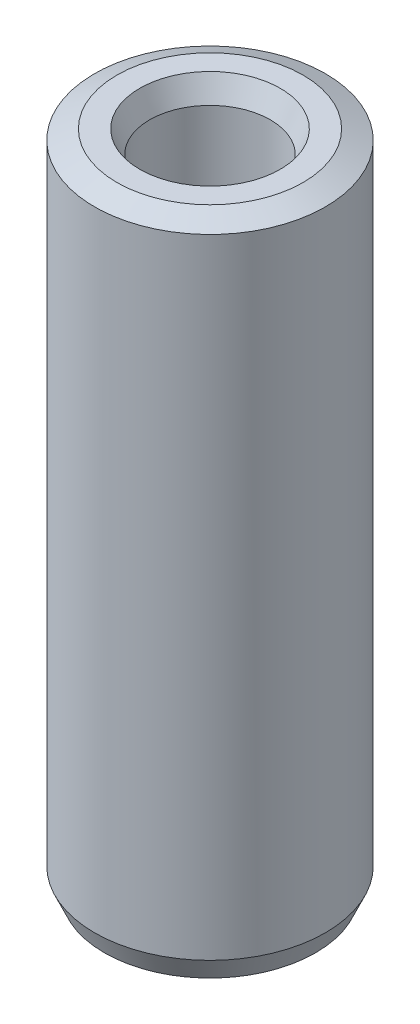
ISO-10303-21;
HEADER;
FILE_DESCRIPTION(('STEP AP214'),'2;1');
FILE_NAME('part.step','',(''),(''),'','','');
FILE_SCHEMA(('AUTOMOTIVE_DESIGN { 1 0 10303 214 1 1 1 1 }'));
ENDSEC;
DATA;
#1=APPLICATION_CONTEXT('core data for automotive mechanical design processes');
#2=APPLICATION_PROTOCOL_DEFINITION('international standard','automotive_design',2000,#1);
#3=PRODUCT_CONTEXT('',#1,'mechanical');
#4=PRODUCT('Part','Part','',(#3));
#5=PRODUCT_RELATED_PRODUCT_CATEGORY('part','',(#4));
#6=PRODUCT_DEFINITION_FORMATION('','',#4);
#7=PRODUCT_DEFINITION_CONTEXT('part definition',#1,'design');
#8=PRODUCT_DEFINITION('design','',#6,#7);
#9=PRODUCT_DEFINITION_SHAPE('','',#8);
#10=(LENGTH_UNIT() NAMED_UNIT(*) SI_UNIT(.MILLI.,.METRE.));
#11=(NAMED_UNIT(*) PLANE_ANGLE_UNIT() SI_UNIT($,.RADIAN.));
#12=(NAMED_UNIT(*) SI_UNIT($,.STERADIAN.) SOLID_ANGLE_UNIT());
#13=UNCERTAINTY_MEASURE_WITH_UNIT(LENGTH_MEASURE(1.E-05),#10,'distance_accuracy_value','');
#14=(GEOMETRIC_REPRESENTATION_CONTEXT(3) GLOBAL_UNCERTAINTY_ASSIGNED_CONTEXT((#13)) GLOBAL_UNIT_ASSIGNED_CONTEXT((#10,
#11,#12)) REPRESENTATION_CONTEXT('',''));
#15=CARTESIAN_POINT('',(0.,0.,0.));
#16=DIRECTION('',(0.,0.,1.));
#17=DIRECTION('',(1.,0.,0.));
#18=AXIS2_PLACEMENT_3D('',#15,#16,#17);
#19=CARTESIAN_POINT('',(0.,42.9435766198368,0.));
#20=DIRECTION('',(0.,-1.,0.));
#21=DIRECTION('',(0.,0.,-1.));
#22=AXIS2_PLACEMENT_3D('',#19,#20,#21);
#23=CYLINDRICAL_SURFACE('',#22,7.5);
#24=CARTESIAN_POINT('',(0.,1.45216016228165,0.));
#25=DIRECTION('',(0.,1.,0.));
#26=DIRECTION('',(0.,0.,1.));
#27=AXIS2_PLACEMENT_3D('',#24,#25,#26);
#28=CIRCLE('',#27,7.5);
#29=CARTESIAN_POINT('',(0.,1.45216016228165,-7.5));
#30=VERTEX_POINT('',#29);
#31=EDGE_CURVE('E10',#30,#30,#28,.T.);
#32=CARTESIAN_POINT('',(0.,42.2998248799971,0.));
#33=DIRECTION('',(0.,1.,0.));
#34=DIRECTION('',(0.,0.,1.));
#35=AXIS2_PLACEMENT_3D('',#32,#33,#34);
#36=CIRCLE('',#35,7.5);
#37=CARTESIAN_POINT('',(0.,42.2998248799971,-7.5));
#38=VERTEX_POINT('',#37);
#39=EDGE_CURVE('E50',#38,#38,#36,.F.);
#40=CARTESIAN_POINT('',(0.,1.45216016228165,-7.5));
#41=CARTESIAN_POINT('',(0.,1.87765666975785,-7.5));
#42=CARTESIAN_POINT('',(0.,2.30315317723405,-7.5));
#43=CARTESIAN_POINT('',(0.,3.15414619218646,-7.5));
#44=CARTESIAN_POINT('',(0.,3.57964269966266,-7.5));
#45=CARTESIAN_POINT('',(0.,4.43063571461507,-7.5));
#46=CARTESIAN_POINT('',(0.,4.85613222209127,-7.5));
#47=CARTESIAN_POINT('',(0.,5.70712523704368,-7.5));
#48=CARTESIAN_POINT('',(0.,6.13262174451988,-7.5));
#49=CARTESIAN_POINT('',(0.,6.98361475947229,-7.5));
#50=CARTESIAN_POINT('',(0.,7.40911126694849,-7.5));
#51=CARTESIAN_POINT('',(0.,8.2601042819009,-7.5));
#52=CARTESIAN_POINT('',(0.,8.6856007893771,-7.5));
#53=CARTESIAN_POINT('',(0.,9.53659380432951,-7.5));
#54=CARTESIAN_POINT('',(0.,9.96209031180571,-7.5));
#55=CARTESIAN_POINT('',(0.,10.8130833267581,-7.5));
#56=CARTESIAN_POINT('',(0.,11.2385798342343,-7.5));
#57=CARTESIAN_POINT('',(0.,12.0895728491867,-7.5));
#58=CARTESIAN_POINT('',(0.,12.5150693566629,-7.5));
#59=CARTESIAN_POINT('',(0.,13.3660623716153,-7.5));
#60=CARTESIAN_POINT('',(0.,13.7915588790915,-7.5));
#61=CARTESIAN_POINT('',(0.,14.6425518940439,-7.5));
#62=CARTESIAN_POINT('',(0.,15.0680484015201,-7.5));
#63=CARTESIAN_POINT('',(0.,15.9190414164725,-7.5));
#64=CARTESIAN_POINT('',(0.,16.3445379239487,-7.5));
#65=CARTESIAN_POINT('',(0.,17.1955309389012,-7.5));
#66=CARTESIAN_POINT('',(0.,17.6210274463774,-7.5));
#67=CARTESIAN_POINT('',(0.,18.4720204613298,-7.5));
#68=CARTESIAN_POINT('',(0.,18.897516968806,-7.5));
#69=CARTESIAN_POINT('',(0.,19.7485099837584,-7.5));
#70=CARTESIAN_POINT('',(0.,20.1740064912346,-7.5));
#71=CARTESIAN_POINT('',(0.,21.024999506187,-7.5));
#72=CARTESIAN_POINT('',(0.,21.4504960136632,-7.5));
#73=CARTESIAN_POINT('',(0.,22.3014890286156,-7.5));
#74=CARTESIAN_POINT('',(0.,22.7269855360918,-7.5));
#75=CARTESIAN_POINT('',(0.,23.5779785510442,-7.5));
#76=CARTESIAN_POINT('',(0.,24.0034750585204,-7.5));
#77=CARTESIAN_POINT('',(0.,24.8544680734728,-7.5));
#78=CARTESIAN_POINT('',(0.,25.279964580949,-7.5));
#79=CARTESIAN_POINT('',(0.,26.1309575959014,-7.5));
#80=CARTESIAN_POINT('',(0.,26.5564541033776,-7.5));
#81=CARTESIAN_POINT('',(0.,27.40744711833,-7.5));
#82=CARTESIAN_POINT('',(0.,27.8329436258062,-7.5));
#83=CARTESIAN_POINT('',(0.,28.6839366407586,-7.5));
#84=CARTESIAN_POINT('',(0.,29.1094331482348,-7.5));
#85=CARTESIAN_POINT('',(0.,29.9604261631872,-7.5));
#86=CARTESIAN_POINT('',(0.,30.3859226706634,-7.5));
#87=CARTESIAN_POINT('',(0.,31.2369156856159,-7.5));
#88=CARTESIAN_POINT('',(0.,31.6624121930921,-7.5));
#89=CARTESIAN_POINT('',(0.,32.5134052080445,-7.5));
#90=CARTESIAN_POINT('',(0.,32.9389017155207,-7.5));
#91=CARTESIAN_POINT('',(0.,33.7898947304731,-7.5));
#92=CARTESIAN_POINT('',(0.,34.2153912379493,-7.5));
#93=CARTESIAN_POINT('',(0.,35.0663842529017,-7.5));
#94=CARTESIAN_POINT('',(0.,35.4918807603779,-7.5));
#95=CARTESIAN_POINT('',(0.,36.3428737753303,-7.5));
#96=CARTESIAN_POINT('',(0.,36.7683702828065,-7.5));
#97=CARTESIAN_POINT('',(0.,37.6193632977589,-7.5));
#98=CARTESIAN_POINT('',(0.,38.0448598052351,-7.5));
#99=CARTESIAN_POINT('',(0.,38.8958528201875,-7.5));
#100=CARTESIAN_POINT('',(0.,39.3213493276637,-7.5));
#101=CARTESIAN_POINT('',(0.,40.1723423426161,-7.5));
#102=CARTESIAN_POINT('',(0.,40.5978388500923,-7.5));
#103=CARTESIAN_POINT('',(0.,41.4488318650447,-7.5));
#104=CARTESIAN_POINT('',(0.,41.8743283725209,-7.5));
#105=CARTESIAN_POINT('',(0.,42.2998248799971,-7.5));
#106=B_SPLINE_CURVE_WITH_KNOTS('',3,(#40,#41,#42,#43,#44,#45,#46,#47,#48,#49,#50,#51,#52,#53,
#54,#55,#56,#57,#58,#59,#60,#61,#62,#63,#64,#65,#66,#67,#68,#69,#70,#71,#72,#73,#74,#75,#76,#77,
#78,#79,#80,#81,#82,#83,#84,#85,#86,#87,#88,#89,#90,#91,#92,#93,#94,#95,#96,#97,#98,#99,#100,
#101,#102,#103,#104,#105),.UNSPECIFIED.,.F.,.F.,(4,2,2,2,2,2,2,2,2,2,2,2,2,2,2,2,2,2,2,2,2,2,2,
2,2,2,2,2,2,2,2,2,4),(0.,1.27648952242861,2.55297904485722,3.82946856728582,5.10595808971444,
6.38244761214304,7.65893713457166,8.93542665700026,10.2119161794289,11.4884057018575,
12.7648952242861,14.0413847467147,15.3178742691433,16.5943637915719,17.8708533140005,
19.1473428364291,20.4238323588577,21.7003218812863,22.976811403715,24.2533009261436,
25.5297904485722,26.8062799710008,28.0827694934294,29.359259015858,30.6357485382866,
31.9122380607152,33.1887275831438,34.4652171055724,35.741706628001,37.0181961504297,
38.2946856728583,39.5711751952869,40.8476647177155),.UNSPECIFIED.);
#107=EDGE_CURVE('BSEAM39',#30,#38,#106,.T.);
#108=ORIENTED_EDGE('',*,*,#31,.T.);
#109=ORIENTED_EDGE('',*,*,#39,.T.);
#110=ORIENTED_EDGE('',*,*,#107,.T.);
#111=ORIENTED_EDGE('',*,*,#107,.F.);
#112=EDGE_LOOP('',(#108,#110,#109,#111));
#113=FACE_BOUND('',#112,.T.);
#114=ADVANCED_FACE('F39',(#113),#23,.T.);
#115=CARTESIAN_POINT('',(0.,42.9435766198368,0.));
#116=DIRECTION('',(0.,1.,0.));
#117=DIRECTION('',(0.,0.,1.));
#118=AXIS2_PLACEMENT_3D('',#115,#116,#117);
#119=PLANE('',#118);
#120=CARTESIAN_POINT('',(0.,42.9435766198368,0.));
#121=DIRECTION('',(0.,1.,0.));
#122=DIRECTION('',(0.,0.,1.));
#123=AXIS2_PLACEMENT_3D('',#120,#121,#122);
#124=CIRCLE('',#123,4.5643758266071);
#125=CARTESIAN_POINT('',(0.,42.9435766198368,4.5643758266071));
#126=VERTEX_POINT('',#125);
#127=EDGE_CURVE('E58',#126,#126,#124,.F.);
#128=ORIENTED_EDGE('',*,*,#127,.T.);
#129=EDGE_LOOP('',(#128));
#130=FACE_BOUND('',#129,.T.);
#131=CARTESIAN_POINT('',(0.,42.9435766198368,0.));
#132=DIRECTION('',(0.,1.,0.));
#133=DIRECTION('',(0.,0.,1.));
#134=AXIS2_PLACEMENT_3D('',#131,#132,#133);
#135=CIRCLE('',#134,6.04783983771852);
#136=CARTESIAN_POINT('',(0.,42.9435766198368,6.04783983771852));
#137=VERTEX_POINT('',#136);
#138=EDGE_CURVE('E61',#137,#137,#135,.T.);
#139=ORIENTED_EDGE('',*,*,#138,.T.);
#140=EDGE_LOOP('',(#139));
#141=FACE_BOUND('',#140,.T.);
#142=ADVANCED_FACE('F88',(#130,#141),#119,.T.);
#143=CARTESIAN_POINT('',(0.,0.,0.));
#144=DIRECTION('',(0.,1.,0.));
#145=DIRECTION('',(0.,0.,1.));
#146=AXIS2_PLACEMENT_3D('',#143,#144,#145);
#147=PLANE('',#146);
#148=CARTESIAN_POINT('',(0.,0.,0.));
#149=DIRECTION('',(0.,1.,0.));
#150=DIRECTION('',(0.,0.,1.));
#151=AXIS2_PLACEMENT_3D('',#148,#149,#150);
#152=CIRCLE('',#151,5.37278424904882);
#153=CARTESIAN_POINT('',(0.,0.,5.37278424904882));
#154=VERTEX_POINT('',#153);
#155=EDGE_CURVE('E51',#154,#154,#152,.T.);
#156=ORIENTED_EDGE('',*,*,#155,.T.);
#157=EDGE_LOOP('',(#156));
#158=FACE_BOUND('',#157,.T.);
#159=CARTESIAN_POINT('',(0.,0.,0.));
#160=DIRECTION('',(0.,1.,0.));
#161=DIRECTION('',(0.,0.,1.));
#162=AXIS2_PLACEMENT_3D('',#159,#160,#161);
#163=CIRCLE('',#162,6.85624826016022);
#164=CARTESIAN_POINT('',(0.,0.,6.85624826016022));
#165=VERTEX_POINT('',#164);
#166=EDGE_CURVE('E54',#165,#165,#163,.F.);
#167=ORIENTED_EDGE('',*,*,#166,.T.);
#168=EDGE_LOOP('',(#167));
#169=FACE_BOUND('',#168,.T.);
#170=ADVANCED_FACE('F83',(#158,#169),#147,.F.);
#171=CARTESIAN_POINT('',(0.,42.9435766198368,0.));
#172=DIRECTION('',(0.,-1.,0.));
#173=DIRECTION('',(0.,0.,-1.));
#174=AXIS2_PLACEMENT_3D('',#171,#172,#173);
#175=CYLINDRICAL_SURFACE('',#174,3.92062408676735);
#176=CARTESIAN_POINT('',(0.,41.4914164575553,0.));
#177=DIRECTION('',(0.,1.,0.));
#178=DIRECTION('',(0.,0.,1.));
#179=AXIS2_PLACEMENT_3D('',#176,#177,#178);
#180=CIRCLE('',#179,3.92062408676735);
#181=CARTESIAN_POINT('',(0.,41.4914164575553,-3.92062408676735));
#182=VERTEX_POINT('',#181);
#183=EDGE_CURVE('E67',#182,#182,#180,.T.);
#184=CARTESIAN_POINT('',(0.,0.643751739839715,0.));
#185=DIRECTION('',(0.,1.,0.));
#186=DIRECTION('',(0.,0.,1.));
#187=AXIS2_PLACEMENT_3D('',#184,#185,#186);
#188=CIRCLE('',#187,3.92062408676735);
#189=CARTESIAN_POINT('',(0.,0.643751739839708,-3.92062408676735));
#190=VERTEX_POINT('',#189);
#191=EDGE_CURVE('E69',#190,#190,#188,.F.);
#192=CARTESIAN_POINT('',(0.,41.4914164575553,-3.92062408676735));
#193=CARTESIAN_POINT('',(0.,41.065919950079,-3.92062408676735));
#194=CARTESIAN_POINT('',(0.,40.6404234426029,-3.92062408676735));
#195=CARTESIAN_POINT('',(0.,39.7894304276504,-3.92062408676735));
#196=CARTESIAN_POINT('',(0.,39.3639339201742,-3.92062408676735));
#197=CARTESIAN_POINT('',(0.,38.5129409052218,-3.92062408676735));
#198=CARTESIAN_POINT('',(0.,38.0874443977456,-3.92062408676735));
#199=CARTESIAN_POINT('',(0.,37.2364513827932,-3.92062408676735));
#200=CARTESIAN_POINT('',(0.,36.810954875317,-3.92062408676735));
#201=CARTESIAN_POINT('',(0.,35.9599618603646,-3.92062408676735));
#202=CARTESIAN_POINT('',(0.,35.5344653528884,-3.92062408676735));
#203=CARTESIAN_POINT('',(0.,34.683472337936,-3.92062408676735));
#204=CARTESIAN_POINT('',(0.,34.2579758304598,-3.92062408676735));
#205=CARTESIAN_POINT('',(0.,33.4069828155074,-3.92062408676735));
#206=CARTESIAN_POINT('',(0.,32.9814863080312,-3.92062408676735));
#207=CARTESIAN_POINT('',(0.,32.1304932930788,-3.92062408676735));
#208=CARTESIAN_POINT('',(0.,31.7049967856026,-3.92062408676735));
#209=CARTESIAN_POINT('',(0.,30.8540037706502,-3.92062408676735));
#210=CARTESIAN_POINT('',(0.,30.428507263174,-3.92062408676735));
#211=CARTESIAN_POINT('',(0.,29.5775142482216,-3.92062408676735));
#212=CARTESIAN_POINT('',(0.,29.1520177407454,-3.92062408676735));
#213=CARTESIAN_POINT('',(0.,28.3010247257929,-3.92062408676735));
#214=CARTESIAN_POINT('',(0.,27.8755282183167,-3.92062408676735));
#215=CARTESIAN_POINT('',(0.,27.0245352033643,-3.92062408676735));
#216=CARTESIAN_POINT('',(0.,26.5990386958881,-3.92062408676735));
#217=CARTESIAN_POINT('',(0.,25.7480456809357,-3.92062408676735));
#218=CARTESIAN_POINT('',(0.,25.3225491734595,-3.92062408676735));
#219=CARTESIAN_POINT('',(0.,24.4715561585071,-3.92062408676735));
#220=CARTESIAN_POINT('',(0.,24.0460596510309,-3.92062408676735));
#221=CARTESIAN_POINT('',(0.,23.1950666360785,-3.92062408676735));
#222=CARTESIAN_POINT('',(0.,22.7695701286023,-3.92062408676735));
#223=CARTESIAN_POINT('',(0.,21.9185771136499,-3.92062408676735));
#224=CARTESIAN_POINT('',(0.,21.4930806061737,-3.92062408676735));
#225=CARTESIAN_POINT('',(0.,20.6420875912213,-3.92062408676735));
#226=CARTESIAN_POINT('',(0.,20.2165910837451,-3.92062408676735));
#227=CARTESIAN_POINT('',(0.,19.3655980687927,-3.92062408676735));
#228=CARTESIAN_POINT('',(0.,18.9401015613165,-3.92062408676735));
#229=CARTESIAN_POINT('',(0.,18.0891085463641,-3.92062408676735));
#230=CARTESIAN_POINT('',(0.,17.6636120388879,-3.92062408676735));
#231=CARTESIAN_POINT('',(0.,16.8126190239354,-3.92062408676735));
#232=CARTESIAN_POINT('',(0.,16.3871225164592,-3.92062408676735));
#233=CARTESIAN_POINT('',(0.,15.5361295015068,-3.92062408676735));
#234=CARTESIAN_POINT('',(0.,15.1106329940306,-3.92062408676735));
#235=CARTESIAN_POINT('',(0.,14.2596399790782,-3.92062408676735));
#236=CARTESIAN_POINT('',(0.,13.834143471602,-3.92062408676735));
#237=CARTESIAN_POINT('',(0.,12.9831504566496,-3.92062408676735));
#238=CARTESIAN_POINT('',(0.,12.5576539491734,-3.92062408676735));
#239=CARTESIAN_POINT('',(0.,11.706660934221,-3.92062408676735));
#240=CARTESIAN_POINT('',(0.,11.2811644267448,-3.92062408676735));
#241=CARTESIAN_POINT('',(0.,10.4301714117924,-3.92062408676735));
#242=CARTESIAN_POINT('',(0.,10.0046749043162,-3.92062408676735));
#243=CARTESIAN_POINT('',(0.,9.15368188936378,-3.92062408676735));
#244=CARTESIAN_POINT('',(0.,8.72818538188758,-3.92062408676735));
#245=CARTESIAN_POINT('',(0.,7.87719236693517,-3.92062408676735));
#246=CARTESIAN_POINT('',(0.,7.45169585945897,-3.92062408676735));
#247=CARTESIAN_POINT('',(0.,6.60070284450656,-3.92062408676735));
#248=CARTESIAN_POINT('',(0.,6.17520633703036,-3.92062408676735));
#249=CARTESIAN_POINT('',(0.,5.32421332207795,-3.92062408676735));
#250=CARTESIAN_POINT('',(0.,4.89871681460174,-3.92062408676735));
#251=CARTESIAN_POINT('',(0.,4.04772379964934,-3.92062408676735));
#252=CARTESIAN_POINT('',(0.,3.62222729217313,-3.92062408676735));
#253=CARTESIAN_POINT('',(0.,2.77123427722073,-3.92062408676735));
#254=CARTESIAN_POINT('',(0.,2.34573776974452,-3.92062408676735));
#255=CARTESIAN_POINT('',(0.,1.49474475479212,-3.92062408676735));
#256=CARTESIAN_POINT('',(0.,1.06924824731591,-3.92062408676735));
#257=CARTESIAN_POINT('',(0.,0.643751739839708,-3.92062408676735));
#258=B_SPLINE_CURVE_WITH_KNOTS('',3,(#192,#193,#194,#195,#196,#197,#198,#199,#200,#201,#202,
#203,#204,#205,#206,#207,#208,#209,#210,#211,#212,#213,#214,#215,#216,#217,#218,#219,#220,#221,
#222,#223,#224,#225,#226,#227,#228,#229,#230,#231,#232,#233,#234,#235,#236,#237,#238,#239,#240,
#241,#242,#243,#244,#245,#246,#247,#248,#249,#250,#251,#252,#253,#254,#255,#256,#257),
.UNSPECIFIED.,.F.,.F.,(4,2,2,2,2,2,2,2,2,2,2,2,2,2,2,2,2,2,2,2,2,2,2,2,2,2,2,2,2,2,2,2,4),(0.,
1.27648952242861,2.55297904485722,3.82946856728583,5.10595808971444,6.38244761214305,
7.65893713457166,8.93542665700027,10.2119161794289,11.4884057018575,12.7648952242861,
14.0413847467147,15.3178742691433,16.5943637915719,17.8708533140005,19.1473428364292,
20.4238323588578,21.7003218812864,22.976811403715,24.2533009261436,25.5297904485722,
26.8062799710008,28.0827694934294,29.359259015858,30.6357485382867,31.9122380607153,
33.1887275831439,34.4652171055725,35.7417066280011,37.0181961504297,38.2946856728583,
39.5711751952869,40.8476647177155),.UNSPECIFIED.);
#259=EDGE_CURVE('BSEAM71',#182,#190,#258,.T.);
#260=ORIENTED_EDGE('',*,*,#183,.T.);
#261=ORIENTED_EDGE('',*,*,#191,.T.);
#262=ORIENTED_EDGE('',*,*,#259,.T.);
#263=ORIENTED_EDGE('',*,*,#259,.F.);
#264=EDGE_LOOP('',(#260,#262,#261,#263));
#265=FACE_BOUND('',#264,.T.);
#266=ADVANCED_FACE('F71',(#265),#175,.F.);
#267=CARTESIAN_POINT('',(0.,41.4914164575553,0.));
#268=DIRECTION('',(0.,1.,0.));
#269=DIRECTION('',(0.,0.,1.));
#270=AXIS2_PLACEMENT_3D('',#267,#268,#269);
#271=CONICAL_SURFACE('',#270,3.92062408676735,0.417273513948871);
#272=ORIENTED_EDGE('',*,*,#127,.F.);
#273=EDGE_LOOP('',(#272));
#274=FACE_BOUND('',#273,.T.);
#275=ORIENTED_EDGE('',*,*,#183,.F.);
#276=EDGE_LOOP('',(#275));
#277=FACE_BOUND('',#276,.T.);
#278=ADVANCED_FACE('F77',(#274,#277),#271,.F.);
#279=CARTESIAN_POINT('',(0.,0.,0.));
#280=DIRECTION('',(0.,-1.,0.));
#281=DIRECTION('',(0.,0.,-1.));
#282=AXIS2_PLACEMENT_3D('',#279,#280,#281);
#283=CONICAL_SURFACE('',#282,5.37278424904882,1.15352281284602);
#284=ORIENTED_EDGE('',*,*,#191,.F.);
#285=EDGE_LOOP('',(#284));
#286=FACE_BOUND('',#285,.T.);
#287=ORIENTED_EDGE('',*,*,#155,.F.);
#288=EDGE_LOOP('',(#287));
#289=FACE_BOUND('',#288,.T.);
#290=ADVANCED_FACE('F73',(#286,#289),#283,.F.);
#291=CARTESIAN_POINT('',(0.,1.45216016228165,0.));
#292=DIRECTION('',(0.,1.,0.));
#293=DIRECTION('',(0.,0.,1.));
#294=AXIS2_PLACEMENT_3D('',#291,#292,#293);
#295=CONICAL_SURFACE('',#294,7.5,0.417273513948872);
#296=ORIENTED_EDGE('',*,*,#166,.F.);
#297=EDGE_LOOP('',(#296));
#298=FACE_BOUND('',#297,.T.);
#299=ORIENTED_EDGE('',*,*,#31,.F.);
#300=EDGE_LOOP('',(#299));
#301=FACE_BOUND('',#300,.T.);
#302=ADVANCED_FACE('F76',(#298,#301),#295,.T.);
#303=CARTESIAN_POINT('',(0.,42.9435766198368,0.));
#304=DIRECTION('',(0.,-1.,0.));
#305=DIRECTION('',(0.,0.,-1.));
#306=AXIS2_PLACEMENT_3D('',#303,#304,#305);
#307=CONICAL_SURFACE('',#306,6.04783983771852,1.15352281284602);
#308=ORIENTED_EDGE('',*,*,#39,.F.);
#309=EDGE_LOOP('',(#308));
#310=FACE_BOUND('',#309,.T.);
#311=ORIENTED_EDGE('',*,*,#138,.F.);
#312=EDGE_LOOP('',(#311));
#313=FACE_BOUND('',#312,.T.);
#314=ADVANCED_FACE('F45',(#310,#313),#307,.T.);
#315=CLOSED_SHELL('',(#114,#142,#170,#266,#278,#290,#302,#314));
#316=MANIFOLD_SOLID_BREP('B2',#315);
#317=ADVANCED_BREP_SHAPE_REPRESENTATION('',(#18,#316),#14);
#318=SHAPE_DEFINITION_REPRESENTATION(#9,#317);
ENDSEC;
END-ISO-10303-21;
